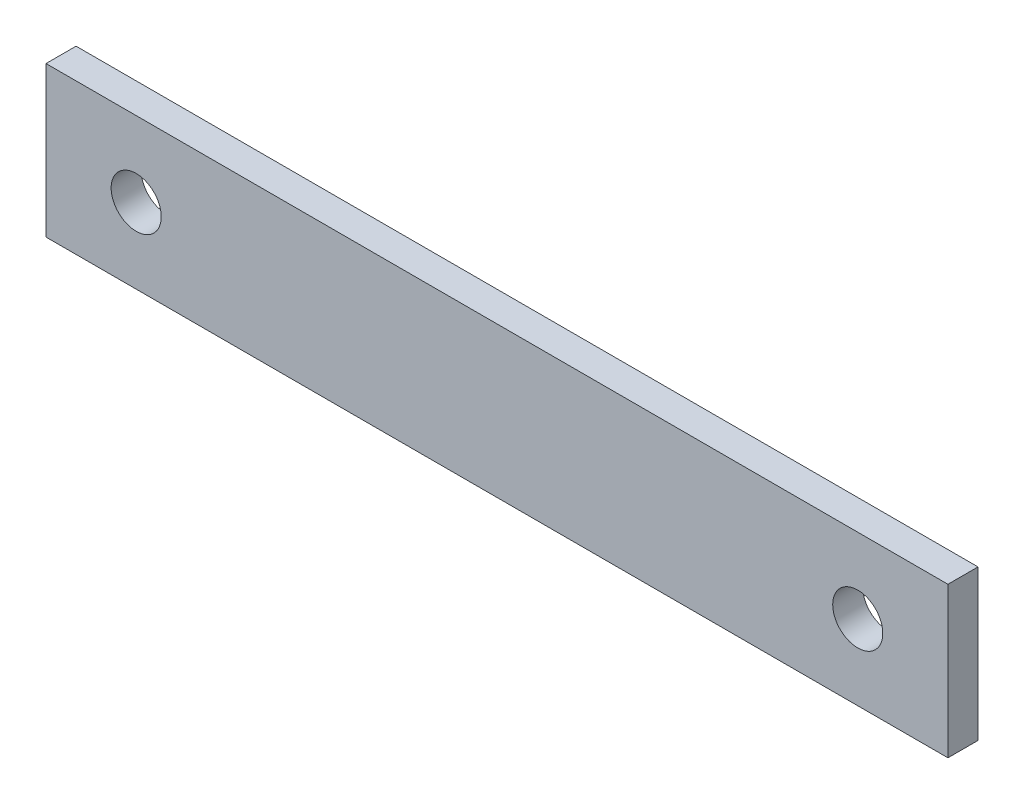
ISO-10303-21;
HEADER;
FILE_DESCRIPTION(('STEP AP214'),'2;1');
FILE_NAME('part.step','',(''),(''),'','','');
FILE_SCHEMA(('AUTOMOTIVE_DESIGN { 1 0 10303 214 1 1 1 1 }'));
ENDSEC;
DATA;
#1=APPLICATION_CONTEXT('core data for automotive mechanical design processes');
#2=APPLICATION_PROTOCOL_DEFINITION('international standard','automotive_design',2000,#1);
#3=PRODUCT_CONTEXT('',#1,'mechanical');
#4=PRODUCT('Part','Part','',(#3));
#5=PRODUCT_RELATED_PRODUCT_CATEGORY('part','',(#4));
#6=PRODUCT_DEFINITION_FORMATION('','',#4);
#7=PRODUCT_DEFINITION_CONTEXT('part definition',#1,'design');
#8=PRODUCT_DEFINITION('design','',#6,#7);
#9=PRODUCT_DEFINITION_SHAPE('','',#8);
#10=(LENGTH_UNIT() NAMED_UNIT(*) SI_UNIT(.MILLI.,.METRE.));
#11=(NAMED_UNIT(*) PLANE_ANGLE_UNIT() SI_UNIT($,.RADIAN.));
#12=(NAMED_UNIT(*) SI_UNIT($,.STERADIAN.) SOLID_ANGLE_UNIT());
#13=UNCERTAINTY_MEASURE_WITH_UNIT(LENGTH_MEASURE(1.E-05),#10,'distance_accuracy_value','');
#14=(GEOMETRIC_REPRESENTATION_CONTEXT(3) GLOBAL_UNCERTAINTY_ASSIGNED_CONTEXT((#13)) GLOBAL_UNIT_ASSIGNED_CONTEXT((#10,
#11,#12)) REPRESENTATION_CONTEXT('',''));
#15=CARTESIAN_POINT('',(0.,0.,0.));
#16=DIRECTION('',(0.,0.,1.));
#17=DIRECTION('',(1.,0.,0.));
#18=AXIS2_PLACEMENT_3D('',#15,#16,#17);
#19=CARTESIAN_POINT('',(0.,0.,3.));
#20=DIRECTION('',(0.,0.,1.));
#21=DIRECTION('',(1.,0.,0.));
#22=AXIS2_PLACEMENT_3D('',#19,#20,#21);
#23=PLANE('',#22);
#24=CARTESIAN_POINT('',(8.99999999999999,7.5,3.));
#25=DIRECTION('',(0.,0.,1.));
#26=DIRECTION('',(1.,0.,0.));
#27=AXIS2_PLACEMENT_3D('',#24,#25,#26);
#28=CIRCLE('',#27,2.5);
#29=CARTESIAN_POINT('',(11.5,7.5,3.));
#30=VERTEX_POINT('',#29);
#31=EDGE_CURVE('E112',#30,#30,#28,.T.);
#32=ORIENTED_EDGE('',*,*,#31,.F.);
#33=EDGE_LOOP('',(#32));
#34=FACE_BOUND('',#33,.T.);
#35=DIRECTION('',(0.,-1.,0.));
#36=VECTOR('',#35,1.);
#37=CARTESIAN_POINT('',(0.,15.,3.));
#38=LINE('',#37,#36);
#39=CARTESIAN_POINT('',(0.,15.,3.));
#40=VERTEX_POINT('',#39);
#41=CARTESIAN_POINT('',(0.,0.,3.));
#42=VERTEX_POINT('',#41);
#43=EDGE_CURVE('E92',#40,#42,#38,.T.);
#44=ORIENTED_EDGE('',*,*,#43,.T.);
#45=DIRECTION('',(1.,0.,0.));
#46=VECTOR('',#45,1.);
#47=CARTESIAN_POINT('',(0.,0.,3.));
#48=LINE('',#47,#46);
#49=CARTESIAN_POINT('',(90.,0.,3.));
#50=VERTEX_POINT('',#49);
#51=EDGE_CURVE('E87',#42,#50,#48,.T.);
#52=ORIENTED_EDGE('',*,*,#51,.T.);
#53=DIRECTION('',(0.,1.,0.));
#54=VECTOR('',#53,1.);
#55=CARTESIAN_POINT('',(90.,0.,3.));
#56=LINE('',#55,#54);
#57=CARTESIAN_POINT('',(90.,15.,3.));
#58=VERTEX_POINT('',#57);
#59=EDGE_CURVE('E90',#50,#58,#56,.T.);
#60=ORIENTED_EDGE('',*,*,#59,.T.);
#61=DIRECTION('',(-1.,0.,0.));
#62=VECTOR('',#61,1.);
#63=CARTESIAN_POINT('',(90.,15.,3.));
#64=LINE('',#63,#62);
#65=EDGE_CURVE('E57',#58,#40,#64,.T.);
#66=ORIENTED_EDGE('',*,*,#65,.T.);
#67=EDGE_LOOP('',(#44,#52,#60,#66));
#68=FACE_BOUND('',#67,.T.);
#69=CARTESIAN_POINT('',(81.,7.49999999999987,3.));
#70=DIRECTION('',(0.,0.,1.));
#71=DIRECTION('',(-1.,0.,0.));
#72=AXIS2_PLACEMENT_3D('',#69,#70,#71);
#73=CIRCLE('',#72,2.50000000000001);
#74=CARTESIAN_POINT('',(78.5,7.49999999999987,3.));
#75=VERTEX_POINT('',#74);
#76=EDGE_CURVE('E134',#75,#75,#73,.T.);
#77=ORIENTED_EDGE('',*,*,#76,.F.);
#78=EDGE_LOOP('',(#77));
#79=FACE_BOUND('',#78,.T.);
#80=ADVANCED_FACE('F39',(#34,#68,#79),#23,.T.);
#81=CARTESIAN_POINT('',(0.,0.,0.));
#82=DIRECTION('',(0.,0.,1.));
#83=DIRECTION('',(1.,0.,0.));
#84=AXIS2_PLACEMENT_3D('',#81,#82,#83);
#85=PLANE('',#84);
#86=DIRECTION('',(0.,-1.,0.));
#87=VECTOR('',#86,1.);
#88=CARTESIAN_POINT('',(0.,15.,0.));
#89=LINE('',#88,#87);
#90=CARTESIAN_POINT('',(0.,15.,0.));
#91=VERTEX_POINT('',#90);
#92=CARTESIAN_POINT('',(0.,0.,0.));
#93=VERTEX_POINT('',#92);
#94=EDGE_CURVE('E108',#91,#93,#89,.T.);
#95=ORIENTED_EDGE('',*,*,#94,.F.);
#96=DIRECTION('',(-1.,0.,0.));
#97=VECTOR('',#96,1.);
#98=CARTESIAN_POINT('',(90.,15.,0.));
#99=LINE('',#98,#97);
#100=CARTESIAN_POINT('',(90.,15.,0.));
#101=VERTEX_POINT('',#100);
#102=EDGE_CURVE('E80',#101,#91,#99,.T.);
#103=ORIENTED_EDGE('',*,*,#102,.F.);
#104=DIRECTION('',(0.,1.,0.));
#105=VECTOR('',#104,1.);
#106=CARTESIAN_POINT('',(90.,0.,0.));
#107=LINE('',#106,#105);
#108=CARTESIAN_POINT('',(90.,0.,0.));
#109=VERTEX_POINT('',#108);
#110=EDGE_CURVE('E74',#109,#101,#107,.T.);
#111=ORIENTED_EDGE('',*,*,#110,.F.);
#112=DIRECTION('',(1.,0.,0.));
#113=VECTOR('',#112,1.);
#114=CARTESIAN_POINT('',(0.,0.,0.));
#115=LINE('',#114,#113);
#116=EDGE_CURVE('E97',#93,#109,#115,.T.);
#117=ORIENTED_EDGE('',*,*,#116,.F.);
#118=EDGE_LOOP('',(#95,#103,#111,#117));
#119=FACE_BOUND('',#118,.T.);
#120=CARTESIAN_POINT('',(8.99999999999999,7.5,0.));
#121=DIRECTION('',(0.,0.,1.));
#122=DIRECTION('',(1.,0.,0.));
#123=AXIS2_PLACEMENT_3D('',#120,#121,#122);
#124=CIRCLE('',#123,2.5);
#125=CARTESIAN_POINT('',(11.5,7.5,0.));
#126=VERTEX_POINT('',#125);
#127=EDGE_CURVE('E130',#126,#126,#124,.T.);
#128=ORIENTED_EDGE('',*,*,#127,.T.);
#129=EDGE_LOOP('',(#128));
#130=FACE_BOUND('',#129,.T.);
#131=CARTESIAN_POINT('',(81.,7.49999999999987,0.));
#132=DIRECTION('',(0.,0.,1.));
#133=DIRECTION('',(-1.,0.,0.));
#134=AXIS2_PLACEMENT_3D('',#131,#132,#133);
#135=CIRCLE('',#134,2.50000000000001);
#136=CARTESIAN_POINT('',(78.5,7.49999999999987,0.));
#137=VERTEX_POINT('',#136);
#138=EDGE_CURVE('E138',#137,#137,#135,.T.);
#139=ORIENTED_EDGE('',*,*,#138,.T.);
#140=EDGE_LOOP('',(#139));
#141=FACE_BOUND('',#140,.T.);
#142=ADVANCED_FACE('F125',(#119,#130,#141),#85,.F.);
#143=CARTESIAN_POINT('',(0.,15.,3.));
#144=DIRECTION('',(1.,0.,0.));
#145=DIRECTION('',(0.,0.,-1.));
#146=AXIS2_PLACEMENT_3D('',#143,#144,#145);
#147=PLANE('',#146);
#148=ORIENTED_EDGE('',*,*,#94,.T.);
#149=DIRECTION('',(0.,0.,-1.));
#150=VECTOR('',#149,1.);
#151=CARTESIAN_POINT('',(0.,0.,3.));
#152=LINE('',#151,#150);
#153=EDGE_CURVE('E11',#42,#93,#152,.T.);
#154=ORIENTED_EDGE('',*,*,#153,.F.);
#155=ORIENTED_EDGE('',*,*,#43,.F.);
#156=DIRECTION('',(0.,0.,-1.));
#157=VECTOR('',#156,1.);
#158=CARTESIAN_POINT('',(0.,15.,3.));
#159=LINE('',#158,#157);
#160=EDGE_CURVE('E104',#40,#91,#159,.T.);
#161=ORIENTED_EDGE('',*,*,#160,.T.);
#162=EDGE_LOOP('',(#148,#154,#155,#161));
#163=FACE_BOUND('',#162,.T.);
#164=ADVANCED_FACE('F41',(#163),#147,.F.);
#165=CARTESIAN_POINT('',(0.,0.,3.));
#166=DIRECTION('',(0.,1.,0.));
#167=DIRECTION('',(0.,0.,1.));
#168=AXIS2_PLACEMENT_3D('',#165,#166,#167);
#169=PLANE('',#168);
#170=ORIENTED_EDGE('',*,*,#116,.T.);
#171=DIRECTION('',(0.,0.,-1.));
#172=VECTOR('',#171,1.);
#173=CARTESIAN_POINT('',(90.,0.,3.));
#174=LINE('',#173,#172);
#175=EDGE_CURVE('E49',#50,#109,#174,.T.);
#176=ORIENTED_EDGE('',*,*,#175,.F.);
#177=ORIENTED_EDGE('',*,*,#51,.F.);
#178=ORIENTED_EDGE('',*,*,#153,.T.);
#179=EDGE_LOOP('',(#170,#176,#177,#178));
#180=FACE_BOUND('',#179,.T.);
#181=ADVANCED_FACE('F96',(#180),#169,.F.);
#182=CARTESIAN_POINT('',(90.,0.,3.));
#183=DIRECTION('',(-1.,0.,0.));
#184=DIRECTION('',(0.,0.,1.));
#185=AXIS2_PLACEMENT_3D('',#182,#183,#184);
#186=PLANE('',#185);
#187=ORIENTED_EDGE('',*,*,#110,.T.);
#188=DIRECTION('',(0.,0.,-1.));
#189=VECTOR('',#188,1.);
#190=CARTESIAN_POINT('',(90.,15.,3.));
#191=LINE('',#190,#189);
#192=EDGE_CURVE('E99',#58,#101,#191,.T.);
#193=ORIENTED_EDGE('',*,*,#192,.F.);
#194=ORIENTED_EDGE('',*,*,#59,.F.);
#195=ORIENTED_EDGE('',*,*,#175,.T.);
#196=EDGE_LOOP('',(#187,#193,#194,#195));
#197=FACE_BOUND('',#196,.T.);
#198=ADVANCED_FACE('F100',(#197),#186,.F.);
#199=CARTESIAN_POINT('',(90.,15.,3.));
#200=DIRECTION('',(0.,-1.,0.));
#201=DIRECTION('',(0.,0.,-1.));
#202=AXIS2_PLACEMENT_3D('',#199,#200,#201);
#203=PLANE('',#202);
#204=ORIENTED_EDGE('',*,*,#102,.T.);
#205=ORIENTED_EDGE('',*,*,#160,.F.);
#206=ORIENTED_EDGE('',*,*,#65,.F.);
#207=ORIENTED_EDGE('',*,*,#192,.T.);
#208=EDGE_LOOP('',(#204,#205,#206,#207));
#209=FACE_BOUND('',#208,.T.);
#210=ADVANCED_FACE('F122',(#209),#203,.F.);
#211=CARTESIAN_POINT('',(8.99999999999999,7.5,3.));
#212=DIRECTION('',(0.,0.,-1.));
#213=DIRECTION('',(-1.,0.,0.));
#214=AXIS2_PLACEMENT_3D('',#211,#212,#213);
#215=CYLINDRICAL_SURFACE('',#214,2.5);
#216=ORIENTED_EDGE('',*,*,#31,.T.);
#217=EDGE_LOOP('',(#216));
#218=FACE_BOUND('',#217,.T.);
#219=ORIENTED_EDGE('',*,*,#127,.F.);
#220=EDGE_LOOP('',(#219));
#221=FACE_BOUND('',#220,.T.);
#222=ADVANCED_FACE('F157',(#218,#221),#215,.F.);
#223=CARTESIAN_POINT('',(81.,7.49999999999987,3.));
#224=DIRECTION('',(0.,0.,-1.));
#225=DIRECTION('',(-1.,0.,0.));
#226=AXIS2_PLACEMENT_3D('',#223,#224,#225);
#227=CYLINDRICAL_SURFACE('',#226,2.50000000000001);
#228=ORIENTED_EDGE('',*,*,#76,.T.);
#229=EDGE_LOOP('',(#228));
#230=FACE_BOUND('',#229,.T.);
#231=ORIENTED_EDGE('',*,*,#138,.F.);
#232=EDGE_LOOP('',(#231));
#233=FACE_BOUND('',#232,.T.);
#234=ADVANCED_FACE('F146',(#230,#233),#227,.F.);
#235=CLOSED_SHELL('',(#80,#142,#164,#181,#198,#210,#222,#234));
#236=MANIFOLD_SOLID_BREP('B2',#235);
#237=ADVANCED_BREP_SHAPE_REPRESENTATION('',(#18,#236),#14);
#238=SHAPE_DEFINITION_REPRESENTATION(#9,#237);
ENDSEC;
END-ISO-10303-21;
